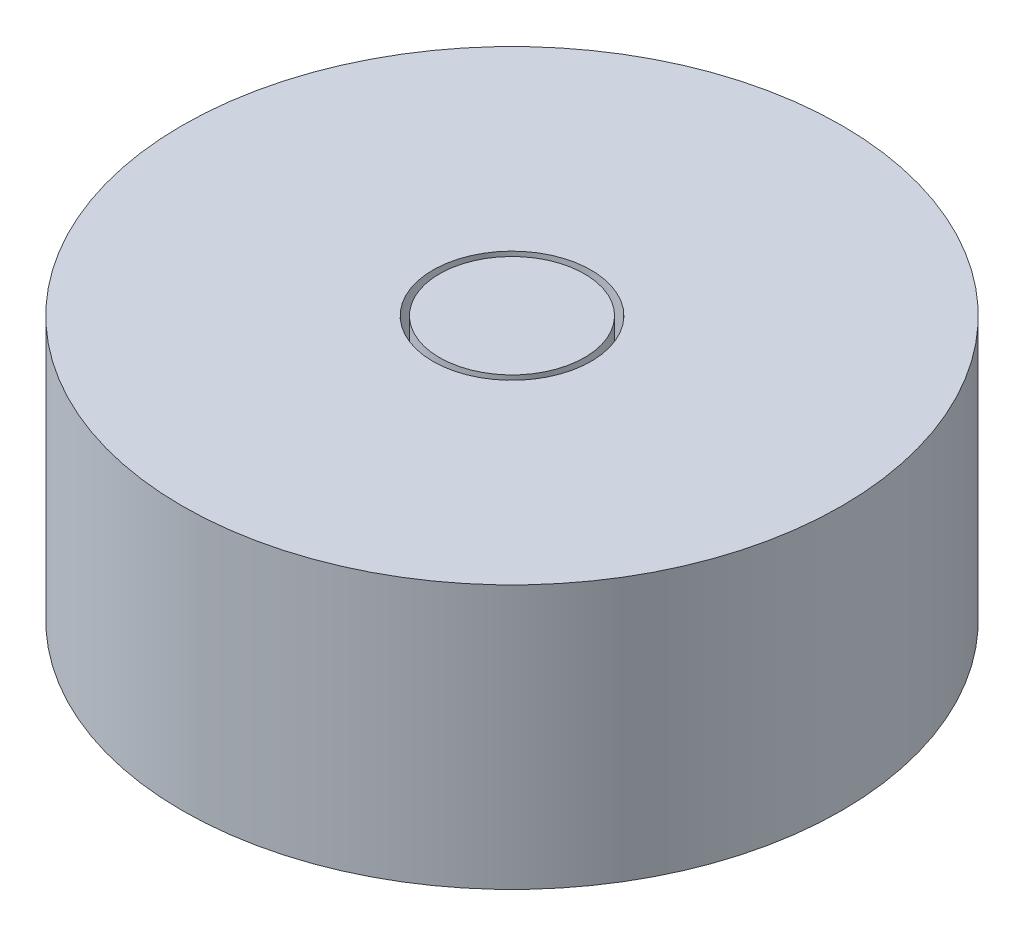
ISO-10303-21;
HEADER;
FILE_DESCRIPTION(('STEP AP214'),'2;1');
FILE_NAME('part.step','',(''),(''),'','','');
FILE_SCHEMA(('AUTOMOTIVE_DESIGN { 1 0 10303 214 1 1 1 1 }'));
ENDSEC;
DATA;
#1=APPLICATION_CONTEXT('core data for automotive mechanical design processes');
#2=APPLICATION_PROTOCOL_DEFINITION('international standard','automotive_design',2000,#1);
#3=PRODUCT_CONTEXT('',#1,'mechanical');
#4=PRODUCT('Part','Part','',(#3));
#5=PRODUCT_RELATED_PRODUCT_CATEGORY('part','',(#4));
#6=PRODUCT_DEFINITION_FORMATION('','',#4);
#7=PRODUCT_DEFINITION_CONTEXT('part definition',#1,'design');
#8=PRODUCT_DEFINITION('design','',#6,#7);
#9=PRODUCT_DEFINITION_SHAPE('','',#8);
#10=(LENGTH_UNIT() NAMED_UNIT(*) SI_UNIT(.MILLI.,.METRE.));
#11=(NAMED_UNIT(*) PLANE_ANGLE_UNIT() SI_UNIT($,.RADIAN.));
#12=(NAMED_UNIT(*) SI_UNIT($,.STERADIAN.) SOLID_ANGLE_UNIT());
#13=UNCERTAINTY_MEASURE_WITH_UNIT(LENGTH_MEASURE(1.E-05),#10,'distance_accuracy_value','');
#14=(GEOMETRIC_REPRESENTATION_CONTEXT(3) GLOBAL_UNCERTAINTY_ASSIGNED_CONTEXT((#13)) GLOBAL_UNIT_ASSIGNED_CONTEXT((#10,
#11,#12)) REPRESENTATION_CONTEXT('',''));
#15=CARTESIAN_POINT('',(0.,0.,0.));
#16=DIRECTION('',(0.,0.,1.));
#17=DIRECTION('',(1.,0.,0.));
#18=AXIS2_PLACEMENT_3D('',#15,#16,#17);
#19=CARTESIAN_POINT('',(0.,5.,0.));
#20=DIRECTION('',(0.,-1.,0.));
#21=DIRECTION('',(0.,0.,-1.));
#22=AXIS2_PLACEMENT_3D('',#19,#20,#21);
#23=CYLINDRICAL_SURFACE('',#22,6.25);
#24=CARTESIAN_POINT('',(0.,5.,0.));
#25=DIRECTION('',(0.,1.,0.));
#26=DIRECTION('',(0.,0.,1.));
#27=AXIS2_PLACEMENT_3D('',#24,#25,#26);
#28=CIRCLE('',#27,6.25);
#29=CARTESIAN_POINT('',(0.,5.,6.25));
#30=VERTEX_POINT('',#29);
#31=EDGE_CURVE('E10',#30,#30,#28,.T.);
#32=ORIENTED_EDGE('',*,*,#31,.F.);
#33=EDGE_LOOP('',(#32));
#34=FACE_BOUND('',#33,.T.);
#35=CARTESIAN_POINT('',(0.,0.,0.));
#36=DIRECTION('',(0.,1.,0.));
#37=DIRECTION('',(0.,0.,1.));
#38=AXIS2_PLACEMENT_3D('',#35,#36,#37);
#39=CIRCLE('',#38,6.25);
#40=CARTESIAN_POINT('',(0.,0.,6.25));
#41=VERTEX_POINT('',#40);
#42=EDGE_CURVE('E32',#41,#41,#39,.T.);
#43=ORIENTED_EDGE('',*,*,#42,.T.);
#44=EDGE_LOOP('',(#43));
#45=FACE_BOUND('',#44,.T.);
#46=ADVANCED_FACE('F29',(#34,#45),#23,.T.);
#47=CARTESIAN_POINT('',(0.,5.,0.));
#48=DIRECTION('',(0.,1.,0.));
#49=DIRECTION('',(0.,0.,1.));
#50=AXIS2_PLACEMENT_3D('',#47,#48,#49);
#51=PLANE('',#50);
#52=CARTESIAN_POINT('',(0.,5.,0.));
#53=DIRECTION('',(0.,1.,0.));
#54=DIRECTION('',(0.,0.,1.));
#55=AXIS2_PLACEMENT_3D('',#52,#53,#54);
#56=CIRCLE('',#55,1.5);
#57=CARTESIAN_POINT('',(0.,5.,1.5));
#58=VERTEX_POINT('',#57);
#59=EDGE_CURVE('E41',#58,#58,#56,.T.);
#60=ORIENTED_EDGE('',*,*,#59,.F.);
#61=EDGE_LOOP('',(#60));
#62=FACE_BOUND('',#61,.T.);
#63=ORIENTED_EDGE('',*,*,#31,.T.);
#64=EDGE_LOOP('',(#63));
#65=FACE_BOUND('',#64,.T.);
#66=ADVANCED_FACE('F69',(#62,#65),#51,.T.);
#67=CARTESIAN_POINT('',(0.,0.,0.));
#68=DIRECTION('',(0.,1.,0.));
#69=DIRECTION('',(0.,0.,1.));
#70=AXIS2_PLACEMENT_3D('',#67,#68,#69);
#71=PLANE('',#70);
#72=ORIENTED_EDGE('',*,*,#42,.F.);
#73=EDGE_LOOP('',(#72));
#74=FACE_BOUND('',#73,.T.);
#75=ADVANCED_FACE('F65',(#74),#71,.F.);
#76=CARTESIAN_POINT('',(0.,4.,0.));
#77=DIRECTION('',(0.,1.,0.));
#78=DIRECTION('',(0.,0.,1.));
#79=AXIS2_PLACEMENT_3D('',#76,#77,#78);
#80=CYLINDRICAL_SURFACE('',#79,1.5);
#81=CARTESIAN_POINT('',(0.,4.,0.));
#82=DIRECTION('',(0.,1.,0.));
#83=DIRECTION('',(0.,0.,1.));
#84=AXIS2_PLACEMENT_3D('',#81,#82,#83);
#85=CIRCLE('',#84,1.5);
#86=CARTESIAN_POINT('',(0.,4.,1.5));
#87=VERTEX_POINT('',#86);
#88=EDGE_CURVE('E39',#87,#87,#85,.T.);
#89=ORIENTED_EDGE('',*,*,#88,.F.);
#90=EDGE_LOOP('',(#89));
#91=FACE_BOUND('',#90,.T.);
#92=ORIENTED_EDGE('',*,*,#59,.T.);
#93=EDGE_LOOP('',(#92));
#94=FACE_BOUND('',#93,.T.);
#95=ADVANCED_FACE('F59',(#91,#94),#80,.F.);
#96=CARTESIAN_POINT('',(0.,4.,0.));
#97=DIRECTION('',(0.,1.,0.));
#98=DIRECTION('',(0.,0.,1.));
#99=AXIS2_PLACEMENT_3D('',#96,#97,#98);
#100=PLANE('',#99);
#101=CARTESIAN_POINT('',(0.,4.,0.));
#102=DIRECTION('',(0.,1.,0.));
#103=DIRECTION('',(0.,0.,1.));
#104=AXIS2_PLACEMENT_3D('',#101,#102,#103);
#105=CIRCLE('',#104,1.375);
#106=CARTESIAN_POINT('',(0.,4.,1.375));
#107=VERTEX_POINT('',#106);
#108=EDGE_CURVE('E44',#107,#107,#105,.T.);
#109=ORIENTED_EDGE('',*,*,#108,.F.);
#110=EDGE_LOOP('',(#109));
#111=FACE_BOUND('',#110,.T.);
#112=ORIENTED_EDGE('',*,*,#88,.T.);
#113=EDGE_LOOP('',(#112));
#114=FACE_BOUND('',#113,.T.);
#115=ADVANCED_FACE('F56',(#111,#114),#100,.T.);
#116=CARTESIAN_POINT('',(0.,4.,0.));
#117=DIRECTION('',(0.,1.,0.));
#118=DIRECTION('',(0.,0.,1.));
#119=AXIS2_PLACEMENT_3D('',#116,#117,#118);
#120=CYLINDRICAL_SURFACE('',#119,1.375);
#121=ORIENTED_EDGE('',*,*,#108,.T.);
#122=EDGE_LOOP('',(#121));
#123=FACE_BOUND('',#122,.T.);
#124=CARTESIAN_POINT('',(0.,5.,0.));
#125=DIRECTION('',(0.,1.,0.));
#126=DIRECTION('',(0.,0.,1.));
#127=AXIS2_PLACEMENT_3D('',#124,#125,#126);
#128=CIRCLE('',#127,1.375);
#129=CARTESIAN_POINT('',(0.,5.,1.375));
#130=VERTEX_POINT('',#129);
#131=EDGE_CURVE('E47',#130,#130,#128,.T.);
#132=ORIENTED_EDGE('',*,*,#131,.F.);
#133=EDGE_LOOP('',(#132));
#134=FACE_BOUND('',#133,.T.);
#135=ADVANCED_FACE('F53',(#123,#134),#120,.T.);
#136=ORIENTED_EDGE('',*,*,#131,.T.);
#137=EDGE_LOOP('',(#136));
#138=FACE_BOUND('',#137,.T.);
#139=ADVANCED_FACE('F72',(#138),#51,.T.);
#140=CLOSED_SHELL('',(#46,#66,#75,#95,#115,#135,#139));
#141=MANIFOLD_SOLID_BREP('B2',#140);
#142=ADVANCED_BREP_SHAPE_REPRESENTATION('',(#18,#141),#14);
#143=SHAPE_DEFINITION_REPRESENTATION(#9,#142);
ENDSEC;
END-ISO-10303-21;
